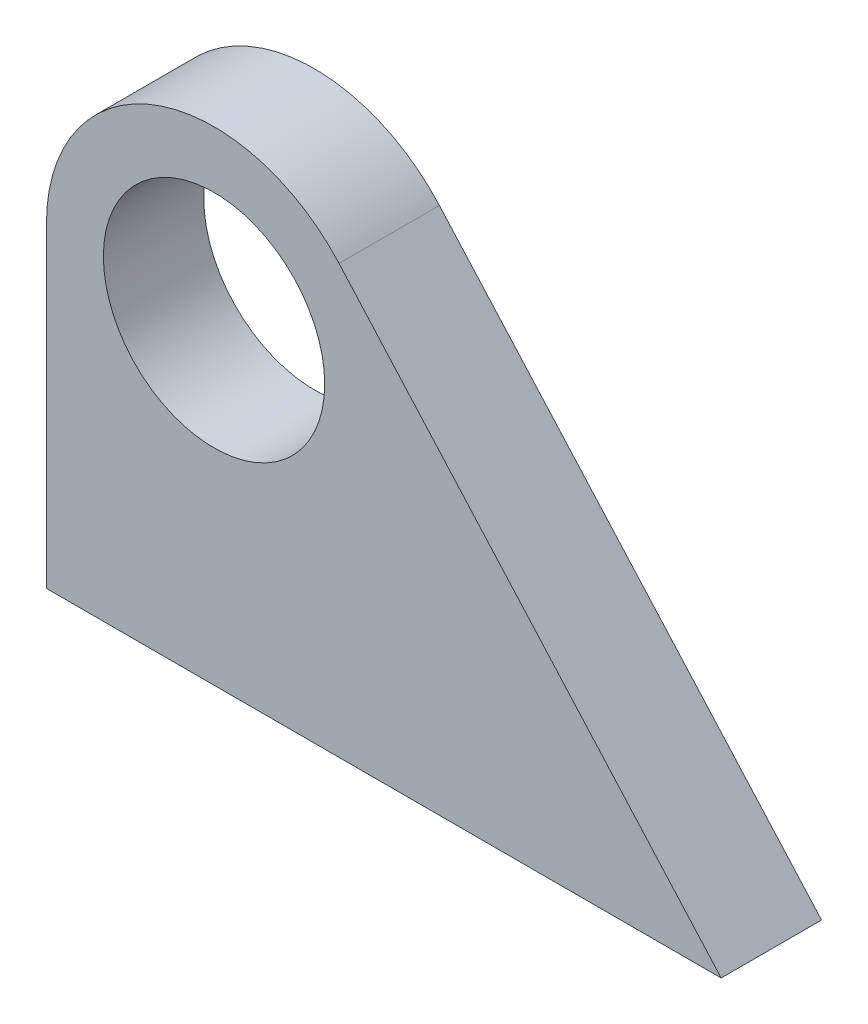
ISO-10303-21;
HEADER;
FILE_DESCRIPTION(('STEP AP214'),'2;1');
FILE_NAME('part.step','',(''),(''),'','','');
FILE_SCHEMA(('AUTOMOTIVE_DESIGN { 1 0 10303 214 1 1 1 1 }'));
ENDSEC;
DATA;
#1=APPLICATION_CONTEXT('core data for automotive mechanical design processes');
#2=APPLICATION_PROTOCOL_DEFINITION('international standard','automotive_design',2000,#1);
#3=PRODUCT_CONTEXT('',#1,'mechanical');
#4=PRODUCT('Part','Part','',(#3));
#5=PRODUCT_RELATED_PRODUCT_CATEGORY('part','',(#4));
#6=PRODUCT_DEFINITION_FORMATION('','',#4);
#7=PRODUCT_DEFINITION_CONTEXT('part definition',#1,'design');
#8=PRODUCT_DEFINITION('design','',#6,#7);
#9=PRODUCT_DEFINITION_SHAPE('','',#8);
#10=(LENGTH_UNIT() NAMED_UNIT(*) SI_UNIT(.MILLI.,.METRE.));
#11=(NAMED_UNIT(*) PLANE_ANGLE_UNIT() SI_UNIT($,.RADIAN.));
#12=(NAMED_UNIT(*) SI_UNIT($,.STERADIAN.) SOLID_ANGLE_UNIT());
#13=UNCERTAINTY_MEASURE_WITH_UNIT(LENGTH_MEASURE(1.E-05),#10,'distance_accuracy_value','');
#14=(GEOMETRIC_REPRESENTATION_CONTEXT(3) GLOBAL_UNCERTAINTY_ASSIGNED_CONTEXT((#13)) GLOBAL_UNIT_ASSIGNED_CONTEXT((#10,
#11,#12)) REPRESENTATION_CONTEXT('',''));
#15=CARTESIAN_POINT('',(0.,0.,0.));
#16=DIRECTION('',(0.,0.,1.));
#17=DIRECTION('',(1.,0.,0.));
#18=AXIS2_PLACEMENT_3D('',#15,#16,#17);
#19=CARTESIAN_POINT('',(5.3,10.,3.175));
#20=DIRECTION('',(0.,0.,-1.));
#21=DIRECTION('',(-1.,0.,0.));
#22=AXIS2_PLACEMENT_3D('',#19,#20,#21);
#23=PLANE('',#22);
#24=DIRECTION('',(1.,0.,0.));
#25=VECTOR('',#24,1.);
#26=CARTESIAN_POINT('',(21.34,0.,3.175));
#27=LINE('',#26,#25);
#28=CARTESIAN_POINT('',(0.,0.,3.175));
#29=VERTEX_POINT('',#28);
#30=CARTESIAN_POINT('',(21.34,0.,3.175));
#31=VERTEX_POINT('',#30);
#32=EDGE_CURVE('E96',#29,#31,#27,.T.);
#33=ORIENTED_EDGE('',*,*,#32,.T.);
#34=DIRECTION('',(-0.666208261425257,0.74576574901824,0.));
#35=VECTOR('',#34,1.);
#36=CARTESIAN_POINT('',(9.25255846979667,13.5309037855539,3.175));
#37=LINE('',#36,#35);
#38=CARTESIAN_POINT('',(9.25255846979667,13.5309037855539,3.175));
#39=VERTEX_POINT('',#38);
#40=EDGE_CURVE('E91',#31,#39,#37,.T.);
#41=ORIENTED_EDGE('',*,*,#40,.T.);
#42=CARTESIAN_POINT('',(5.3,10.,3.175));
#43=DIRECTION('',(0.,0.,1.));
#44=DIRECTION('',(-1.,0.,0.));
#45=AXIS2_PLACEMENT_3D('',#42,#43,#44);
#46=CIRCLE('',#45,5.3);
#47=CARTESIAN_POINT('',(0.,10.,3.175));
#48=VERTEX_POINT('',#47);
#49=EDGE_CURVE('E94',#39,#48,#46,.T.);
#50=ORIENTED_EDGE('',*,*,#49,.T.);
#51=DIRECTION('',(0.,-1.,0.));
#52=VECTOR('',#51,1.);
#53=CARTESIAN_POINT('',(0.,0.,3.175));
#54=LINE('',#53,#52);
#55=EDGE_CURVE('E61',#48,#29,#54,.T.);
#56=ORIENTED_EDGE('',*,*,#55,.T.);
#57=EDGE_LOOP('',(#33,#41,#50,#56));
#58=FACE_BOUND('',#57,.T.);
#59=CARTESIAN_POINT('',(5.3,10.,3.175));
#60=DIRECTION('',(0.,0.,1.));
#61=DIRECTION('',(1.,0.,0.));
#62=AXIS2_PLACEMENT_3D('',#59,#60,#61);
#63=CIRCLE('',#62,3.5);
#64=CARTESIAN_POINT('',(8.8,10.,3.175));
#65=VERTEX_POINT('',#64);
#66=EDGE_CURVE('E116',#65,#65,#63,.T.);
#67=ORIENTED_EDGE('',*,*,#66,.F.);
#68=EDGE_LOOP('',(#67));
#69=FACE_BOUND('',#68,.T.);
#70=ADVANCED_FACE('F43',(#58,#69),#23,.F.);
#71=CARTESIAN_POINT('',(5.3,10.,0.));
#72=DIRECTION('',(0.,0.,-1.));
#73=DIRECTION('',(-1.,0.,0.));
#74=AXIS2_PLACEMENT_3D('',#71,#72,#73);
#75=PLANE('',#74);
#76=DIRECTION('',(1.,0.,0.));
#77=VECTOR('',#76,1.);
#78=CARTESIAN_POINT('',(21.34,0.,0.));
#79=LINE('',#78,#77);
#80=CARTESIAN_POINT('',(0.,0.,0.));
#81=VERTEX_POINT('',#80);
#82=CARTESIAN_POINT('',(21.34,0.,0.));
#83=VERTEX_POINT('',#82);
#84=EDGE_CURVE('E112',#81,#83,#79,.T.);
#85=ORIENTED_EDGE('',*,*,#84,.F.);
#86=DIRECTION('',(0.,-1.,0.));
#87=VECTOR('',#86,1.);
#88=CARTESIAN_POINT('',(0.,0.,0.));
#89=LINE('',#88,#87);
#90=CARTESIAN_POINT('',(0.,10.,0.));
#91=VERTEX_POINT('',#90);
#92=EDGE_CURVE('E84',#91,#81,#89,.T.);
#93=ORIENTED_EDGE('',*,*,#92,.F.);
#94=CARTESIAN_POINT('',(5.3,10.,0.));
#95=DIRECTION('',(0.,0.,1.));
#96=DIRECTION('',(-1.,0.,0.));
#97=AXIS2_PLACEMENT_3D('',#94,#95,#96);
#98=CIRCLE('',#97,5.3);
#99=CARTESIAN_POINT('',(9.25255846979667,13.5309037855539,0.));
#100=VERTEX_POINT('',#99);
#101=EDGE_CURVE('E78',#100,#91,#98,.T.);
#102=ORIENTED_EDGE('',*,*,#101,.F.);
#103=DIRECTION('',(-0.666208261425257,0.74576574901824,0.));
#104=VECTOR('',#103,1.);
#105=CARTESIAN_POINT('',(9.25255846979667,13.5309037855539,0.));
#106=LINE('',#105,#104);
#107=EDGE_CURVE('E101',#83,#100,#106,.T.);
#108=ORIENTED_EDGE('',*,*,#107,.F.);
#109=EDGE_LOOP('',(#85,#93,#102,#108));
#110=FACE_BOUND('',#109,.T.);
#111=CARTESIAN_POINT('',(5.3,10.,0.));
#112=DIRECTION('',(0.,0.,1.));
#113=DIRECTION('',(1.,0.,0.));
#114=AXIS2_PLACEMENT_3D('',#111,#112,#113);
#115=CIRCLE('',#114,3.5);
#116=CARTESIAN_POINT('',(8.8,10.,0.));
#117=VERTEX_POINT('',#116);
#118=EDGE_CURVE('E134',#117,#117,#115,.T.);
#119=ORIENTED_EDGE('',*,*,#118,.T.);
#120=EDGE_LOOP('',(#119));
#121=FACE_BOUND('',#120,.T.);
#122=ADVANCED_FACE('F129',(#110,#121),#75,.T.);
#123=CARTESIAN_POINT('',(21.34,0.,3.175));
#124=DIRECTION('',(0.,1.,0.));
#125=DIRECTION('',(-1.,0.,0.));
#126=AXIS2_PLACEMENT_3D('',#123,#124,#125);
#127=PLANE('',#126);
#128=ORIENTED_EDGE('',*,*,#84,.T.);
#129=DIRECTION('',(0.,0.,-1.));
#130=VECTOR('',#129,1.);
#131=CARTESIAN_POINT('',(21.34,0.,3.175));
#132=LINE('',#131,#130);
#133=EDGE_CURVE('E11',#31,#83,#132,.T.);
#134=ORIENTED_EDGE('',*,*,#133,.F.);
#135=ORIENTED_EDGE('',*,*,#32,.F.);
#136=DIRECTION('',(0.,0.,-1.));
#137=VECTOR('',#136,1.);
#138=CARTESIAN_POINT('',(0.,0.,3.175));
#139=LINE('',#138,#137);
#140=EDGE_CURVE('E108',#29,#81,#139,.T.);
#141=ORIENTED_EDGE('',*,*,#140,.T.);
#142=EDGE_LOOP('',(#128,#134,#135,#141));
#143=FACE_BOUND('',#142,.T.);
#144=ADVANCED_FACE('F45',(#143),#127,.F.);
#145=CARTESIAN_POINT('',(9.25255846979667,13.5309037855539,3.175));
#146=DIRECTION('',(-0.74576574901824,-0.666208261425257,0.));
#147=DIRECTION('',(0.666208261425257,-0.74576574901824,0.));
#148=AXIS2_PLACEMENT_3D('',#145,#146,#147);
#149=PLANE('',#148);
#150=ORIENTED_EDGE('',*,*,#107,.T.);
#151=DIRECTION('',(0.,0.,-1.));
#152=VECTOR('',#151,1.);
#153=CARTESIAN_POINT('',(9.25255846979667,13.5309037855539,3.175));
#154=LINE('',#153,#152);
#155=EDGE_CURVE('E53',#39,#100,#154,.T.);
#156=ORIENTED_EDGE('',*,*,#155,.F.);
#157=ORIENTED_EDGE('',*,*,#40,.F.);
#158=ORIENTED_EDGE('',*,*,#133,.T.);
#159=EDGE_LOOP('',(#150,#156,#157,#158));
#160=FACE_BOUND('',#159,.T.);
#161=ADVANCED_FACE('F100',(#160),#149,.F.);
#162=CARTESIAN_POINT('',(5.3,10.,3.175));
#163=DIRECTION('',(0.,0.,-1.));
#164=DIRECTION('',(-1.,0.,0.));
#165=AXIS2_PLACEMENT_3D('',#162,#163,#164);
#166=CYLINDRICAL_SURFACE('',#165,5.3);
#167=ORIENTED_EDGE('',*,*,#101,.T.);
#168=DIRECTION('',(0.,0.,-1.));
#169=VECTOR('',#168,1.);
#170=CARTESIAN_POINT('',(0.,10.,3.175));
#171=LINE('',#170,#169);
#172=EDGE_CURVE('E103',#48,#91,#171,.T.);
#173=ORIENTED_EDGE('',*,*,#172,.F.);
#174=ORIENTED_EDGE('',*,*,#49,.F.);
#175=ORIENTED_EDGE('',*,*,#155,.T.);
#176=EDGE_LOOP('',(#167,#173,#174,#175));
#177=FACE_BOUND('',#176,.T.);
#178=ADVANCED_FACE('F104',(#177),#166,.T.);
#179=CARTESIAN_POINT('',(0.,0.,3.175));
#180=DIRECTION('',(1.,0.,0.));
#181=DIRECTION('',(0.,0.,-1.));
#182=AXIS2_PLACEMENT_3D('',#179,#180,#181);
#183=PLANE('',#182);
#184=ORIENTED_EDGE('',*,*,#92,.T.);
#185=ORIENTED_EDGE('',*,*,#140,.F.);
#186=ORIENTED_EDGE('',*,*,#55,.F.);
#187=ORIENTED_EDGE('',*,*,#172,.T.);
#188=EDGE_LOOP('',(#184,#185,#186,#187));
#189=FACE_BOUND('',#188,.T.);
#190=ADVANCED_FACE('F126',(#189),#183,.F.);
#191=CARTESIAN_POINT('',(5.3,10.,3.175));
#192=DIRECTION('',(0.,0.,-1.));
#193=DIRECTION('',(-1.,0.,0.));
#194=AXIS2_PLACEMENT_3D('',#191,#192,#193);
#195=CYLINDRICAL_SURFACE('',#194,3.5);
#196=ORIENTED_EDGE('',*,*,#66,.T.);
#197=EDGE_LOOP('',(#196));
#198=FACE_BOUND('',#197,.T.);
#199=ORIENTED_EDGE('',*,*,#118,.F.);
#200=EDGE_LOOP('',(#199));
#201=FACE_BOUND('',#200,.T.);
#202=ADVANCED_FACE('F142',(#198,#201),#195,.F.);
#203=CLOSED_SHELL('',(#70,#122,#144,#161,#178,#190,#202));
#204=MANIFOLD_SOLID_BREP('B2',#203);
#205=ADVANCED_BREP_SHAPE_REPRESENTATION('',(#18,#204),#14);
#206=SHAPE_DEFINITION_REPRESENTATION(#9,#205);
ENDSEC;
END-ISO-10303-21;
